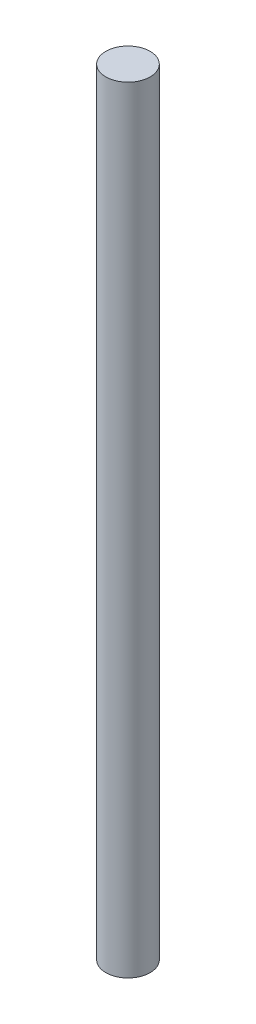
ISO-10303-21;
HEADER;
FILE_DESCRIPTION(('STEP AP214'),'2;1');
FILE_NAME('part.step','',(''),(''),'','','');
FILE_SCHEMA(('AUTOMOTIVE_DESIGN { 1 0 10303 214 1 1 1 1 }'));
ENDSEC;
DATA;
#1=APPLICATION_CONTEXT('core data for automotive mechanical design processes');
#2=APPLICATION_PROTOCOL_DEFINITION('international standard','automotive_design',2000,#1);
#3=PRODUCT_CONTEXT('',#1,'mechanical');
#4=PRODUCT('Part','Part','',(#3));
#5=PRODUCT_RELATED_PRODUCT_CATEGORY('part','',(#4));
#6=PRODUCT_DEFINITION_FORMATION('','',#4);
#7=PRODUCT_DEFINITION_CONTEXT('part definition',#1,'design');
#8=PRODUCT_DEFINITION('design','',#6,#7);
#9=PRODUCT_DEFINITION_SHAPE('','',#8);
#10=(LENGTH_UNIT() NAMED_UNIT(*) SI_UNIT(.MILLI.,.METRE.));
#11=(NAMED_UNIT(*) PLANE_ANGLE_UNIT() SI_UNIT($,.RADIAN.));
#12=(NAMED_UNIT(*) SI_UNIT($,.STERADIAN.) SOLID_ANGLE_UNIT());
#13=UNCERTAINTY_MEASURE_WITH_UNIT(LENGTH_MEASURE(1.E-05),#10,'distance_accuracy_value','');
#14=(GEOMETRIC_REPRESENTATION_CONTEXT(3) GLOBAL_UNCERTAINTY_ASSIGNED_CONTEXT((#13)) GLOBAL_UNIT_ASSIGNED_CONTEXT((#10,
#11,#12)) REPRESENTATION_CONTEXT('',''));
#15=CARTESIAN_POINT('',(0.,0.,0.));
#16=DIRECTION('',(0.,0.,1.));
#17=DIRECTION('',(1.,0.,0.));
#18=AXIS2_PLACEMENT_3D('',#15,#16,#17);
#19=CARTESIAN_POINT('',(0.,70.,0.));
#20=DIRECTION('',(0.,-1.,0.));
#21=DIRECTION('',(0.,0.,-1.));
#22=AXIS2_PLACEMENT_3D('',#19,#20,#21);
#23=CYLINDRICAL_SURFACE('',#22,2.);
#24=CARTESIAN_POINT('',(0.,70.,0.));
#25=DIRECTION('',(0.,1.,0.));
#26=DIRECTION('',(0.,0.,1.));
#27=AXIS2_PLACEMENT_3D('',#24,#25,#26);
#28=CIRCLE('',#27,2.);
#29=CARTESIAN_POINT('',(0.,70.,2.));
#30=VERTEX_POINT('',#29);
#31=EDGE_CURVE('E11',#30,#30,#28,.T.);
#32=ORIENTED_EDGE('',*,*,#31,.F.);
#33=EDGE_LOOP('',(#32));
#34=FACE_BOUND('',#33,.T.);
#35=CARTESIAN_POINT('',(0.,0.,0.));
#36=DIRECTION('',(0.,1.,0.));
#37=DIRECTION('',(0.,0.,1.));
#38=AXIS2_PLACEMENT_3D('',#35,#36,#37);
#39=CIRCLE('',#38,2.);
#40=CARTESIAN_POINT('',(0.,0.,2.));
#41=VERTEX_POINT('',#40);
#42=EDGE_CURVE('E47',#41,#41,#39,.T.);
#43=ORIENTED_EDGE('',*,*,#42,.T.);
#44=EDGE_LOOP('',(#43));
#45=FACE_BOUND('',#44,.T.);
#46=ADVANCED_FACE('F44',(#34,#45),#23,.T.);
#47=CARTESIAN_POINT('',(0.,70.,0.));
#48=DIRECTION('',(0.,1.,0.));
#49=DIRECTION('',(0.,0.,1.));
#50=AXIS2_PLACEMENT_3D('',#47,#48,#49);
#51=PLANE('',#50);
#52=ORIENTED_EDGE('',*,*,#31,.T.);
#53=EDGE_LOOP('',(#52));
#54=FACE_BOUND('',#53,.T.);
#55=ADVANCED_FACE('F61',(#54),#51,.T.);
#56=CARTESIAN_POINT('',(0.,0.,0.));
#57=DIRECTION('',(0.,1.,0.));
#58=DIRECTION('',(0.,0.,1.));
#59=AXIS2_PLACEMENT_3D('',#56,#57,#58);
#60=PLANE('',#59);
#61=ORIENTED_EDGE('',*,*,#42,.F.);
#62=EDGE_LOOP('',(#61));
#63=FACE_BOUND('',#62,.T.);
#64=ADVANCED_FACE('F59',(#63),#60,.F.);
#65=CLOSED_SHELL('',(#46,#55,#64));
#66=MANIFOLD_SOLID_BREP('B2',#65);
#67=ADVANCED_BREP_SHAPE_REPRESENTATION('',(#18,#66),#14);
#68=SHAPE_DEFINITION_REPRESENTATION(#9,#67);
ENDSEC;
END-ISO-10303-21;
